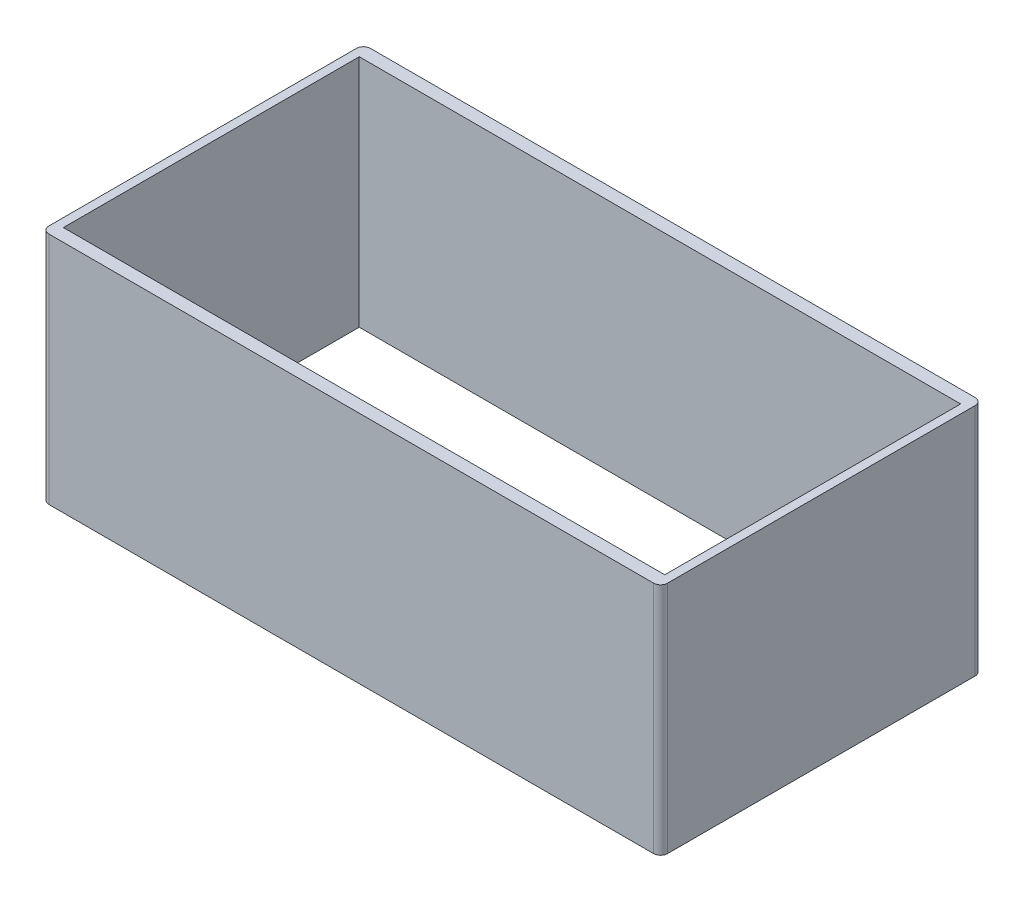
ISO-10303-21;
HEADER;
FILE_DESCRIPTION(('STEP AP214'),'2;1');
FILE_NAME('part.step','',(''),(''),'','','');
FILE_SCHEMA(('AUTOMOTIVE_DESIGN { 1 0 10303 214 1 1 1 1 }'));
ENDSEC;
DATA;
#1=APPLICATION_CONTEXT('core data for automotive mechanical design processes');
#2=APPLICATION_PROTOCOL_DEFINITION('international standard','automotive_design',2000,#1);
#3=PRODUCT_CONTEXT('',#1,'mechanical');
#4=PRODUCT('Part','Part','',(#3));
#5=PRODUCT_RELATED_PRODUCT_CATEGORY('part','',(#4));
#6=PRODUCT_DEFINITION_FORMATION('','',#4);
#7=PRODUCT_DEFINITION_CONTEXT('part definition',#1,'design');
#8=PRODUCT_DEFINITION('design','',#6,#7);
#9=PRODUCT_DEFINITION_SHAPE('','',#8);
#10=(LENGTH_UNIT() NAMED_UNIT(*) SI_UNIT(.MILLI.,.METRE.));
#11=(NAMED_UNIT(*) PLANE_ANGLE_UNIT() SI_UNIT($,.RADIAN.));
#12=(NAMED_UNIT(*) SI_UNIT($,.STERADIAN.) SOLID_ANGLE_UNIT());
#13=UNCERTAINTY_MEASURE_WITH_UNIT(LENGTH_MEASURE(1.E-05),#10,'distance_accuracy_value','');
#14=(GEOMETRIC_REPRESENTATION_CONTEXT(3) GLOBAL_UNCERTAINTY_ASSIGNED_CONTEXT((#13)) GLOBAL_UNIT_ASSIGNED_CONTEXT((#10,
#11,#12)) REPRESENTATION_CONTEXT('',''));
#15=CARTESIAN_POINT('',(0.,0.,0.));
#16=DIRECTION('',(0.,0.,1.));
#17=DIRECTION('',(1.,0.,0.));
#18=AXIS2_PLACEMENT_3D('',#15,#16,#17);
#19=CARTESIAN_POINT('',(-22.185,16.8,-11.53));
#20=DIRECTION('',(1.,0.,0.));
#21=DIRECTION('',(0.,0.,-1.));
#22=AXIS2_PLACEMENT_3D('',#19,#20,#21);
#23=PLANE('',#22);
#24=DIRECTION('',(0.,0.,1.));
#25=VECTOR('',#24,1.);
#26=CARTESIAN_POINT('',(-22.185,16.8,-11.53));
#27=LINE('',#26,#25);
#28=CARTESIAN_POINT('',(-22.185,16.8,-11.03));
#29=VERTEX_POINT('',#28);
#30=CARTESIAN_POINT('',(-22.185,16.8,11.03));
#31=VERTEX_POINT('',#30);
#32=EDGE_CURVE('E165',#29,#31,#27,.T.);
#33=ORIENTED_EDGE('',*,*,#32,.F.);
#34=DIRECTION('',(0.,-1.,0.));
#35=VECTOR('',#34,1.);
#36=CARTESIAN_POINT('',(-22.185,0.,-11.03));
#37=LINE('',#36,#35);
#38=CARTESIAN_POINT('',(-22.185,0.,-11.03));
#39=VERTEX_POINT('',#38);
#40=EDGE_CURVE('E189',#29,#39,#37,.T.);
#41=ORIENTED_EDGE('',*,*,#40,.T.);
#42=DIRECTION('',(0.,0.,1.));
#43=VECTOR('',#42,1.);
#44=CARTESIAN_POINT('',(-22.185,0.,-11.53));
#45=LINE('',#44,#43);
#46=CARTESIAN_POINT('',(-22.185,0.,11.03));
#47=VERTEX_POINT('',#46);
#48=EDGE_CURVE('E177',#39,#47,#45,.T.);
#49=ORIENTED_EDGE('',*,*,#48,.T.);
#50=DIRECTION('',(0.,-1.,0.));
#51=VECTOR('',#50,1.);
#52=CARTESIAN_POINT('',(-22.185,16.8,11.03));
#53=LINE('',#52,#51);
#54=EDGE_CURVE('E176',#47,#31,#53,.F.);
#55=ORIENTED_EDGE('',*,*,#54,.T.);
#56=EDGE_LOOP('',(#33,#41,#49,#55));
#57=FACE_BOUND('',#56,.T.);
#58=ADVANCED_FACE('F35',(#57),#23,.F.);
#59=CARTESIAN_POINT('',(-22.185,16.8,11.53));
#60=DIRECTION('',(0.,0.,-1.));
#61=DIRECTION('',(-1.,0.,0.));
#62=AXIS2_PLACEMENT_3D('',#59,#60,#61);
#63=PLANE('',#62);
#64=DIRECTION('',(1.,0.,0.));
#65=VECTOR('',#64,1.);
#66=CARTESIAN_POINT('',(-22.185,16.8,11.53));
#67=LINE('',#66,#65);
#68=CARTESIAN_POINT('',(-21.685,16.8,11.53));
#69=VERTEX_POINT('',#68);
#70=CARTESIAN_POINT('',(21.685,16.8,11.53));
#71=VERTEX_POINT('',#70);
#72=EDGE_CURVE('E168',#69,#71,#67,.T.);
#73=ORIENTED_EDGE('',*,*,#72,.F.);
#74=DIRECTION('',(0.,-1.,0.));
#75=VECTOR('',#74,1.);
#76=CARTESIAN_POINT('',(-21.685,16.8,11.53));
#77=LINE('',#76,#75);
#78=CARTESIAN_POINT('',(-21.685,0.,11.53));
#79=VERTEX_POINT('',#78);
#80=EDGE_CURVE('E11',#69,#79,#77,.T.);
#81=ORIENTED_EDGE('',*,*,#80,.T.);
#82=DIRECTION('',(1.,0.,0.));
#83=VECTOR('',#82,1.);
#84=CARTESIAN_POINT('',(-22.185,0.,11.53));
#85=LINE('',#84,#83);
#86=CARTESIAN_POINT('',(21.685,0.,11.53));
#87=VERTEX_POINT('',#86);
#88=EDGE_CURVE('E180',#79,#87,#85,.T.);
#89=ORIENTED_EDGE('',*,*,#88,.T.);
#90=DIRECTION('',(0.,-1.,0.));
#91=VECTOR('',#90,1.);
#92=CARTESIAN_POINT('',(21.685,16.8,11.53));
#93=LINE('',#92,#91);
#94=EDGE_CURVE('E43',#87,#71,#93,.F.);
#95=ORIENTED_EDGE('',*,*,#94,.T.);
#96=EDGE_LOOP('',(#73,#81,#89,#95));
#97=FACE_BOUND('',#96,.T.);
#98=ADVANCED_FACE('F218',(#97),#63,.F.);
#99=CARTESIAN_POINT('',(22.185,16.8,-11.53));
#100=DIRECTION('',(1.,0.,0.));
#101=DIRECTION('',(0.,0.,-1.));
#102=AXIS2_PLACEMENT_3D('',#99,#100,#101);
#103=PLANE('',#102);
#104=DIRECTION('',(0.,0.,1.));
#105=VECTOR('',#104,1.);
#106=CARTESIAN_POINT('',(22.185,0.,-11.53));
#107=LINE('',#106,#105);
#108=CARTESIAN_POINT('',(22.185,0.,-11.03));
#109=VERTEX_POINT('',#108);
#110=CARTESIAN_POINT('',(22.185,0.,11.03));
#111=VERTEX_POINT('',#110);
#112=EDGE_CURVE('E183',#109,#111,#107,.T.);
#113=ORIENTED_EDGE('',*,*,#112,.F.);
#114=DIRECTION('',(0.,-1.,0.));
#115=VECTOR('',#114,1.);
#116=CARTESIAN_POINT('',(22.185,16.8,-11.03));
#117=LINE('',#116,#115);
#118=CARTESIAN_POINT('',(22.185,16.8,-11.03));
#119=VERTEX_POINT('',#118);
#120=EDGE_CURVE('E57',#109,#119,#117,.F.);
#121=ORIENTED_EDGE('',*,*,#120,.T.);
#122=DIRECTION('',(0.,0.,1.));
#123=VECTOR('',#122,1.);
#124=CARTESIAN_POINT('',(22.185,16.8,-11.53));
#125=LINE('',#124,#123);
#126=CARTESIAN_POINT('',(22.185,16.8,11.03));
#127=VERTEX_POINT('',#126);
#128=EDGE_CURVE('E171',#119,#127,#125,.T.);
#129=ORIENTED_EDGE('',*,*,#128,.T.);
#130=DIRECTION('',(0.,-1.,0.));
#131=VECTOR('',#130,1.);
#132=CARTESIAN_POINT('',(22.185,0.,11.03));
#133=LINE('',#132,#131);
#134=EDGE_CURVE('E212',#127,#111,#133,.T.);
#135=ORIENTED_EDGE('',*,*,#134,.T.);
#136=EDGE_LOOP('',(#113,#121,#129,#135));
#137=FACE_BOUND('',#136,.T.);
#138=ADVANCED_FACE('F226',(#137),#103,.T.);
#139=CARTESIAN_POINT('',(-22.185,16.8,-11.53));
#140=DIRECTION('',(0.,0.,-1.));
#141=DIRECTION('',(-1.,0.,0.));
#142=AXIS2_PLACEMENT_3D('',#139,#140,#141);
#143=PLANE('',#142);
#144=DIRECTION('',(1.,0.,0.));
#145=VECTOR('',#144,1.);
#146=CARTESIAN_POINT('',(-22.185,0.,-11.53));
#147=LINE('',#146,#145);
#148=CARTESIAN_POINT('',(-21.685,0.,-11.53));
#149=VERTEX_POINT('',#148);
#150=CARTESIAN_POINT('',(21.685,0.,-11.53));
#151=VERTEX_POINT('',#150);
#152=EDGE_CURVE('E169',#149,#151,#147,.T.);
#153=ORIENTED_EDGE('',*,*,#152,.F.);
#154=DIRECTION('',(0.,-1.,0.));
#155=VECTOR('',#154,1.);
#156=CARTESIAN_POINT('',(-21.685,16.8,-11.53));
#157=LINE('',#156,#155);
#158=CARTESIAN_POINT('',(-21.685,16.8,-11.53));
#159=VERTEX_POINT('',#158);
#160=EDGE_CURVE('E203',#149,#159,#157,.F.);
#161=ORIENTED_EDGE('',*,*,#160,.T.);
#162=DIRECTION('',(1.,0.,0.));
#163=VECTOR('',#162,1.);
#164=CARTESIAN_POINT('',(-22.185,16.8,-11.53));
#165=LINE('',#164,#163);
#166=CARTESIAN_POINT('',(21.685,16.8,-11.53));
#167=VERTEX_POINT('',#166);
#168=EDGE_CURVE('E173',#159,#167,#165,.T.);
#169=ORIENTED_EDGE('',*,*,#168,.T.);
#170=DIRECTION('',(0.,-1.,0.));
#171=VECTOR('',#170,1.);
#172=CARTESIAN_POINT('',(21.685,16.8,-11.53));
#173=LINE('',#172,#171);
#174=EDGE_CURVE('E200',#167,#151,#173,.T.);
#175=ORIENTED_EDGE('',*,*,#174,.T.);
#176=EDGE_LOOP('',(#153,#161,#169,#175));
#177=FACE_BOUND('',#176,.T.);
#178=ADVANCED_FACE('F234',(#177),#143,.T.);
#179=CARTESIAN_POINT('',(0.,16.8,0.));
#180=DIRECTION('',(0.,1.,0.));
#181=DIRECTION('',(0.,0.,1.));
#182=AXIS2_PLACEMENT_3D('',#179,#180,#181);
#183=PLANE('',#182);
#184=DIRECTION('',(0.,0.,1.));
#185=VECTOR('',#184,1.);
#186=CARTESIAN_POINT('',(-21.565,16.8,-11.53));
#187=LINE('',#186,#185);
#188=CARTESIAN_POINT('',(-21.565,16.8,-10.61));
#189=VERTEX_POINT('',#188);
#190=CARTESIAN_POINT('',(-21.565,16.8,10.61));
#191=VERTEX_POINT('',#190);
#192=EDGE_CURVE('E152',#189,#191,#187,.T.);
#193=ORIENTED_EDGE('',*,*,#192,.F.);
#194=DIRECTION('',(1.,0.,0.));
#195=VECTOR('',#194,1.);
#196=CARTESIAN_POINT('',(-22.185,16.8,-10.61));
#197=LINE('',#196,#195);
#198=CARTESIAN_POINT('',(21.565,16.8,-10.61));
#199=VERTEX_POINT('',#198);
#200=EDGE_CURVE('E134',#189,#199,#197,.T.);
#201=ORIENTED_EDGE('',*,*,#200,.T.);
#202=DIRECTION('',(0.,0.,1.));
#203=VECTOR('',#202,1.);
#204=CARTESIAN_POINT('',(21.565,16.8,-11.53));
#205=LINE('',#204,#203);
#206=CARTESIAN_POINT('',(21.565,16.8,10.61));
#207=VERTEX_POINT('',#206);
#208=EDGE_CURVE('E161',#199,#207,#205,.T.);
#209=ORIENTED_EDGE('',*,*,#208,.T.);
#210=DIRECTION('',(1.,0.,0.));
#211=VECTOR('',#210,1.);
#212=CARTESIAN_POINT('',(-22.185,16.8,10.61));
#213=LINE('',#212,#211);
#214=EDGE_CURVE('E154',#191,#207,#213,.T.);
#215=ORIENTED_EDGE('',*,*,#214,.F.);
#216=EDGE_LOOP('',(#193,#201,#209,#215));
#217=FACE_BOUND('',#216,.T.);
#218=ORIENTED_EDGE('',*,*,#168,.F.);
#219=CARTESIAN_POINT('',(-21.685,16.8,-11.03));
#220=DIRECTION('',(0.,1.,0.));
#221=DIRECTION('',(0.,0.,1.));
#222=AXIS2_PLACEMENT_3D('',#219,#220,#221);
#223=CIRCLE('',#222,0.5);
#224=EDGE_CURVE('E210',#159,#29,#223,.T.);
#225=ORIENTED_EDGE('',*,*,#224,.T.);
#226=ORIENTED_EDGE('',*,*,#32,.T.);
#227=CARTESIAN_POINT('',(-21.685,16.8,11.03));
#228=DIRECTION('',(0.,1.,0.));
#229=DIRECTION('',(0.,0.,1.));
#230=AXIS2_PLACEMENT_3D('',#227,#228,#229);
#231=CIRCLE('',#230,0.5);
#232=EDGE_CURVE('E206',#31,#69,#231,.T.);
#233=ORIENTED_EDGE('',*,*,#232,.T.);
#234=ORIENTED_EDGE('',*,*,#72,.T.);
#235=CARTESIAN_POINT('',(21.685,16.8,11.03));
#236=DIRECTION('',(0.,1.,0.));
#237=DIRECTION('',(0.,0.,1.));
#238=AXIS2_PLACEMENT_3D('',#235,#236,#237);
#239=CIRCLE('',#238,0.5);
#240=EDGE_CURVE('E50',#71,#127,#239,.T.);
#241=ORIENTED_EDGE('',*,*,#240,.T.);
#242=ORIENTED_EDGE('',*,*,#128,.F.);
#243=CARTESIAN_POINT('',(21.685,16.8,-11.03));
#244=DIRECTION('',(0.,1.,0.));
#245=DIRECTION('',(0.,0.,1.));
#246=AXIS2_PLACEMENT_3D('',#243,#244,#245);
#247=CIRCLE('',#246,0.5);
#248=EDGE_CURVE('E208',#119,#167,#247,.T.);
#249=ORIENTED_EDGE('',*,*,#248,.T.);
#250=EDGE_LOOP('',(#218,#225,#226,#233,#234,#241,#242,#249));
#251=FACE_BOUND('',#250,.T.);
#252=ADVANCED_FACE('F223',(#217,#251),#183,.T.);
#253=CARTESIAN_POINT('',(0.,0.,0.));
#254=DIRECTION('',(0.,1.,0.));
#255=DIRECTION('',(0.,0.,1.));
#256=AXIS2_PLACEMENT_3D('',#253,#254,#255);
#257=PLANE('',#256);
#258=DIRECTION('',(1.,0.,0.));
#259=VECTOR('',#258,1.);
#260=CARTESIAN_POINT('',(-22.185,0.,-10.61));
#261=LINE('',#260,#259);
#262=CARTESIAN_POINT('',(-21.565,0.,-10.61));
#263=VERTEX_POINT('',#262);
#264=CARTESIAN_POINT('',(21.565,0.,-10.61));
#265=VERTEX_POINT('',#264);
#266=EDGE_CURVE('E131',#263,#265,#261,.T.);
#267=ORIENTED_EDGE('',*,*,#266,.F.);
#268=DIRECTION('',(0.,0.,1.));
#269=VECTOR('',#268,1.);
#270=CARTESIAN_POINT('',(-21.565,0.,-11.53));
#271=LINE('',#270,#269);
#272=CARTESIAN_POINT('',(-21.565,0.,10.61));
#273=VERTEX_POINT('',#272);
#274=EDGE_CURVE('E141',#263,#273,#271,.T.);
#275=ORIENTED_EDGE('',*,*,#274,.T.);
#276=DIRECTION('',(1.,0.,0.));
#277=VECTOR('',#276,1.);
#278=CARTESIAN_POINT('',(-22.185,0.,10.61));
#279=LINE('',#278,#277);
#280=CARTESIAN_POINT('',(21.565,0.,10.61));
#281=VERTEX_POINT('',#280);
#282=EDGE_CURVE('E147',#273,#281,#279,.T.);
#283=ORIENTED_EDGE('',*,*,#282,.T.);
#284=DIRECTION('',(0.,0.,1.));
#285=VECTOR('',#284,1.);
#286=CARTESIAN_POINT('',(21.565,0.,-11.53));
#287=LINE('',#286,#285);
#288=EDGE_CURVE('E151',#265,#281,#287,.T.);
#289=ORIENTED_EDGE('',*,*,#288,.F.);
#290=EDGE_LOOP('',(#267,#275,#283,#289));
#291=FACE_BOUND('',#290,.T.);
#292=ORIENTED_EDGE('',*,*,#48,.F.);
#293=CARTESIAN_POINT('',(-21.685,0.,-11.03));
#294=DIRECTION('',(0.,1.,0.));
#295=DIRECTION('',(0.,0.,1.));
#296=AXIS2_PLACEMENT_3D('',#293,#294,#295);
#297=CIRCLE('',#296,0.5);
#298=EDGE_CURVE('E198',#39,#149,#297,.F.);
#299=ORIENTED_EDGE('',*,*,#298,.T.);
#300=ORIENTED_EDGE('',*,*,#152,.T.);
#301=CARTESIAN_POINT('',(21.685,0.,-11.03));
#302=DIRECTION('',(0.,1.,0.));
#303=DIRECTION('',(0.,0.,1.));
#304=AXIS2_PLACEMENT_3D('',#301,#302,#303);
#305=CIRCLE('',#304,0.5);
#306=EDGE_CURVE('E196',#151,#109,#305,.F.);
#307=ORIENTED_EDGE('',*,*,#306,.T.);
#308=ORIENTED_EDGE('',*,*,#112,.T.);
#309=CARTESIAN_POINT('',(21.685,0.,11.03));
#310=DIRECTION('',(0.,1.,0.));
#311=DIRECTION('',(0.,0.,1.));
#312=AXIS2_PLACEMENT_3D('',#309,#310,#311);
#313=CIRCLE('',#312,0.5);
#314=EDGE_CURVE('E192',#111,#87,#313,.F.);
#315=ORIENTED_EDGE('',*,*,#314,.T.);
#316=ORIENTED_EDGE('',*,*,#88,.F.);
#317=CARTESIAN_POINT('',(-21.685,0.,11.03));
#318=DIRECTION('',(0.,1.,0.));
#319=DIRECTION('',(0.,0.,1.));
#320=AXIS2_PLACEMENT_3D('',#317,#318,#319);
#321=CIRCLE('',#320,0.5);
#322=EDGE_CURVE('E194',#79,#47,#321,.F.);
#323=ORIENTED_EDGE('',*,*,#322,.T.);
#324=EDGE_LOOP('',(#292,#299,#300,#307,#308,#315,#316,#323));
#325=FACE_BOUND('',#324,.T.);
#326=ADVANCED_FACE('F149',(#291,#325),#257,.F.);
#327=CARTESIAN_POINT('',(-21.565,16.8,-11.53));
#328=DIRECTION('',(1.,0.,0.));
#329=DIRECTION('',(0.,0.,-1.));
#330=AXIS2_PLACEMENT_3D('',#327,#328,#329);
#331=PLANE('',#330);
#332=ORIENTED_EDGE('',*,*,#274,.F.);
#333=DIRECTION('',(0.,-1.,0.));
#334=VECTOR('',#333,1.);
#335=CARTESIAN_POINT('',(-21.565,16.8,-10.61));
#336=LINE('',#335,#334);
#337=EDGE_CURVE('E126',#189,#263,#336,.T.);
#338=ORIENTED_EDGE('',*,*,#337,.F.);
#339=ORIENTED_EDGE('',*,*,#192,.T.);
#340=DIRECTION('',(0.,-1.,0.));
#341=VECTOR('',#340,1.);
#342=CARTESIAN_POINT('',(-21.565,16.8,10.61));
#343=LINE('',#342,#341);
#344=EDGE_CURVE('E144',#191,#273,#343,.T.);
#345=ORIENTED_EDGE('',*,*,#344,.T.);
#346=EDGE_LOOP('',(#332,#338,#339,#345));
#347=FACE_BOUND('',#346,.T.);
#348=ADVANCED_FACE('F142',(#347),#331,.T.);
#349=CARTESIAN_POINT('',(-22.185,16.8,10.61));
#350=DIRECTION('',(0.,0.,-1.));
#351=DIRECTION('',(-1.,0.,0.));
#352=AXIS2_PLACEMENT_3D('',#349,#350,#351);
#353=PLANE('',#352);
#354=ORIENTED_EDGE('',*,*,#282,.F.);
#355=ORIENTED_EDGE('',*,*,#344,.F.);
#356=ORIENTED_EDGE('',*,*,#214,.T.);
#357=DIRECTION('',(0.,-1.,0.));
#358=VECTOR('',#357,1.);
#359=CARTESIAN_POINT('',(21.565,16.8,10.61));
#360=LINE('',#359,#358);
#361=EDGE_CURVE('E363',#207,#281,#360,.T.);
#362=ORIENTED_EDGE('',*,*,#361,.T.);
#363=EDGE_LOOP('',(#354,#355,#356,#362));
#364=FACE_BOUND('',#363,.T.);
#365=ADVANCED_FACE('F269',(#364),#353,.T.);
#366=CARTESIAN_POINT('',(21.565,16.8,-11.53));
#367=DIRECTION('',(1.,0.,0.));
#368=DIRECTION('',(0.,0.,-1.));
#369=AXIS2_PLACEMENT_3D('',#366,#367,#368);
#370=PLANE('',#369);
#371=ORIENTED_EDGE('',*,*,#288,.T.);
#372=ORIENTED_EDGE('',*,*,#361,.F.);
#373=ORIENTED_EDGE('',*,*,#208,.F.);
#374=DIRECTION('',(0.,-1.,0.));
#375=VECTOR('',#374,1.);
#376=CARTESIAN_POINT('',(21.565,16.8,-10.61));
#377=LINE('',#376,#375);
#378=EDGE_CURVE('E137',#199,#265,#377,.T.);
#379=ORIENTED_EDGE('',*,*,#378,.T.);
#380=EDGE_LOOP('',(#371,#372,#373,#379));
#381=FACE_BOUND('',#380,.T.);
#382=ADVANCED_FACE('F264',(#381),#370,.F.);
#383=CARTESIAN_POINT('',(-22.185,16.8,-10.61));
#384=DIRECTION('',(0.,0.,-1.));
#385=DIRECTION('',(-1.,0.,0.));
#386=AXIS2_PLACEMENT_3D('',#383,#384,#385);
#387=PLANE('',#386);
#388=ORIENTED_EDGE('',*,*,#266,.T.);
#389=ORIENTED_EDGE('',*,*,#378,.F.);
#390=ORIENTED_EDGE('',*,*,#200,.F.);
#391=ORIENTED_EDGE('',*,*,#337,.T.);
#392=EDGE_LOOP('',(#388,#389,#390,#391));
#393=FACE_BOUND('',#392,.T.);
#394=ADVANCED_FACE('F128',(#393),#387,.F.);
#395=CARTESIAN_POINT('',(-21.685,16.8,-11.03));
#396=DIRECTION('',(0.,1.,0.));
#397=DIRECTION('',(0.,0.,1.));
#398=AXIS2_PLACEMENT_3D('',#395,#396,#397);
#399=CYLINDRICAL_SURFACE('',#398,0.5);
#400=ORIENTED_EDGE('',*,*,#224,.F.);
#401=ORIENTED_EDGE('',*,*,#160,.F.);
#402=ORIENTED_EDGE('',*,*,#298,.F.);
#403=ORIENTED_EDGE('',*,*,#40,.F.);
#404=EDGE_LOOP('',(#400,#401,#402,#403));
#405=FACE_BOUND('',#404,.T.);
#406=ADVANCED_FACE('F240',(#405),#399,.T.);
#407=CARTESIAN_POINT('',(21.685,16.8,-11.03));
#408=DIRECTION('',(0.,-1.,0.));
#409=DIRECTION('',(0.,0.,-1.));
#410=AXIS2_PLACEMENT_3D('',#407,#408,#409);
#411=CYLINDRICAL_SURFACE('',#410,0.5);
#412=ORIENTED_EDGE('',*,*,#248,.F.);
#413=ORIENTED_EDGE('',*,*,#120,.F.);
#414=ORIENTED_EDGE('',*,*,#306,.F.);
#415=ORIENTED_EDGE('',*,*,#174,.F.);
#416=EDGE_LOOP('',(#412,#413,#414,#415));
#417=FACE_BOUND('',#416,.T.);
#418=ADVANCED_FACE('F232',(#417),#411,.T.);
#419=CARTESIAN_POINT('',(-21.685,16.8,11.03));
#420=DIRECTION('',(0.,-1.,0.));
#421=DIRECTION('',(0.,0.,-1.));
#422=AXIS2_PLACEMENT_3D('',#419,#420,#421);
#423=CYLINDRICAL_SURFACE('',#422,0.5);
#424=ORIENTED_EDGE('',*,*,#232,.F.);
#425=ORIENTED_EDGE('',*,*,#54,.F.);
#426=ORIENTED_EDGE('',*,*,#322,.F.);
#427=ORIENTED_EDGE('',*,*,#80,.F.);
#428=EDGE_LOOP('',(#424,#425,#426,#427));
#429=FACE_BOUND('',#428,.T.);
#430=ADVANCED_FACE('F244',(#429),#423,.T.);
#431=CARTESIAN_POINT('',(21.685,16.8,11.03));
#432=DIRECTION('',(0.,1.,0.));
#433=DIRECTION('',(0.,0.,1.));
#434=AXIS2_PLACEMENT_3D('',#431,#432,#433);
#435=CYLINDRICAL_SURFACE('',#434,0.5);
#436=ORIENTED_EDGE('',*,*,#240,.F.);
#437=ORIENTED_EDGE('',*,*,#94,.F.);
#438=ORIENTED_EDGE('',*,*,#314,.F.);
#439=ORIENTED_EDGE('',*,*,#134,.F.);
#440=EDGE_LOOP('',(#436,#437,#438,#439));
#441=FACE_BOUND('',#440,.T.);
#442=ADVANCED_FACE('F37',(#441),#435,.T.);
#443=CLOSED_SHELL('',(#58,#98,#138,#178,#252,#326,#348,#365,#382,#394,#406,#418,#430,#442));
#444=MANIFOLD_SOLID_BREP('B2',#443);
#445=ADVANCED_BREP_SHAPE_REPRESENTATION('',(#18,#444),#14);
#446=SHAPE_DEFINITION_REPRESENTATION(#9,#445);
ENDSEC;
END-ISO-10303-21;
